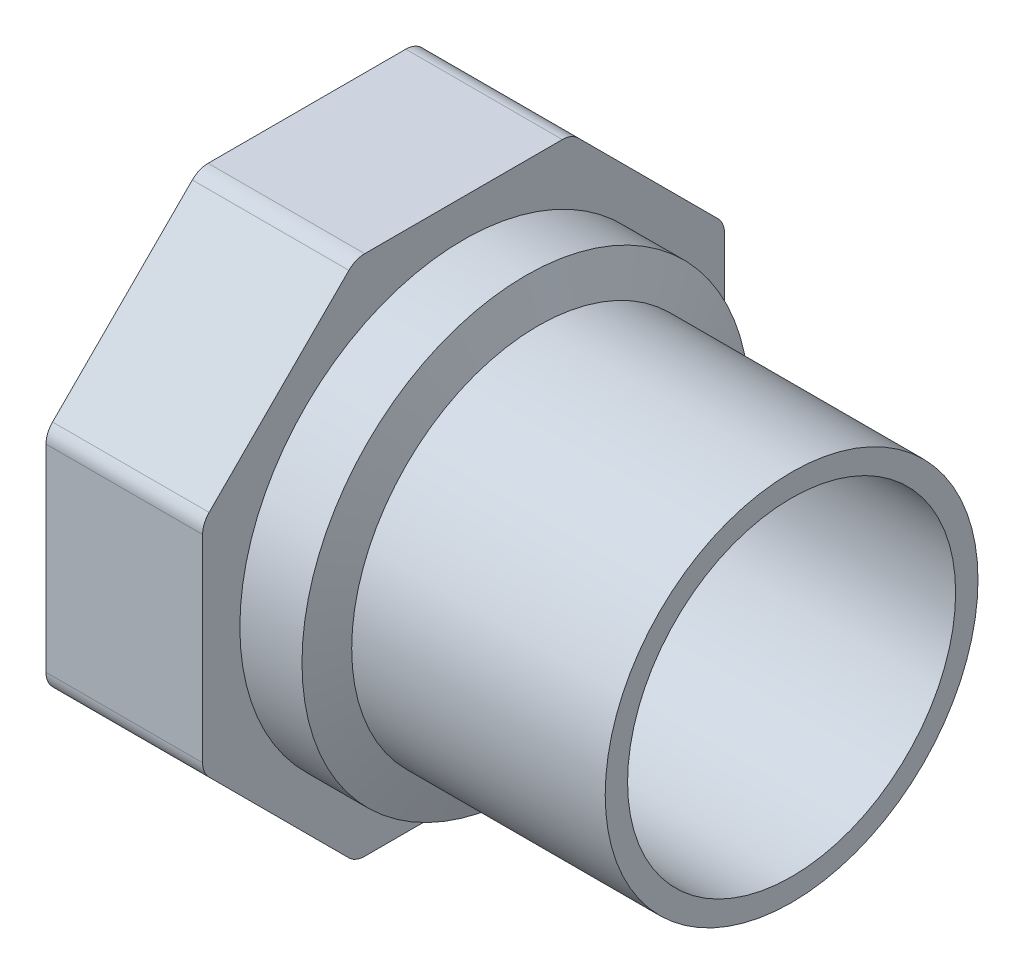
ISO-10303-21;
HEADER;
FILE_DESCRIPTION(('STEP AP214'),'2;1');
FILE_NAME('part.step','',(''),(''),'','','');
FILE_SCHEMA(('AUTOMOTIVE_DESIGN { 1 0 10303 214 1 1 1 1 }'));
ENDSEC;
DATA;
#1=APPLICATION_CONTEXT('core data for automotive mechanical design processes');
#2=APPLICATION_PROTOCOL_DEFINITION('international standard','automotive_design',2000,#1);
#3=PRODUCT_CONTEXT('',#1,'mechanical');
#4=PRODUCT('Part','Part','',(#3));
#5=PRODUCT_RELATED_PRODUCT_CATEGORY('part','',(#4));
#6=PRODUCT_DEFINITION_FORMATION('','',#4);
#7=PRODUCT_DEFINITION_CONTEXT('part definition',#1,'design');
#8=PRODUCT_DEFINITION('design','',#6,#7);
#9=PRODUCT_DEFINITION_SHAPE('','',#8);
#10=(LENGTH_UNIT() NAMED_UNIT(*) SI_UNIT(.MILLI.,.METRE.));
#11=(NAMED_UNIT(*) PLANE_ANGLE_UNIT() SI_UNIT($,.RADIAN.));
#12=(NAMED_UNIT(*) SI_UNIT($,.STERADIAN.) SOLID_ANGLE_UNIT());
#13=UNCERTAINTY_MEASURE_WITH_UNIT(LENGTH_MEASURE(1.E-05),#10,'distance_accuracy_value','');
#14=(GEOMETRIC_REPRESENTATION_CONTEXT(3) GLOBAL_UNCERTAINTY_ASSIGNED_CONTEXT((#13)) GLOBAL_UNIT_ASSIGNED_CONTEXT((#10,
#11,#12)) REPRESENTATION_CONTEXT('',''));
#15=CARTESIAN_POINT('',(0.,0.,0.));
#16=DIRECTION('',(0.,0.,1.));
#17=DIRECTION('',(1.,0.,0.));
#18=AXIS2_PLACEMENT_3D('',#15,#16,#17);
#19=CARTESIAN_POINT('',(-34.,0.,0.));
#20=DIRECTION('',(-1.,0.,0.));
#21=DIRECTION('',(0.,0.,1.));
#22=AXIS2_PLACEMENT_3D('',#19,#20,#21);
#23=CYLINDRICAL_SURFACE('',#22,25.);
#24=CARTESIAN_POINT('',(-34.,0.,0.));
#25=DIRECTION('',(1.,0.,0.));
#26=DIRECTION('',(0.,1.,0.));
#27=AXIS2_PLACEMENT_3D('',#24,#25,#26);
#28=CIRCLE('',#27,25.);
#29=CARTESIAN_POINT('',(-34.,25.,0.));
#30=VERTEX_POINT('',#29);
#31=EDGE_CURVE('E193',#30,#30,#28,.F.);
#32=ORIENTED_EDGE('',*,*,#31,.F.);
#33=EDGE_LOOP('',(#32));
#34=FACE_BOUND('',#33,.T.);
#35=CARTESIAN_POINT('',(0.,0.,0.));
#36=DIRECTION('',(-1.,0.,0.));
#37=DIRECTION('',(0.,0.,1.));
#38=AXIS2_PLACEMENT_3D('',#35,#36,#37);
#39=CIRCLE('',#38,25.);
#40=CARTESIAN_POINT('',(0.,0.,25.));
#41=VERTEX_POINT('',#40);
#42=EDGE_CURVE('E18',#41,#41,#39,.F.);
#43=ORIENTED_EDGE('',*,*,#42,.F.);
#44=EDGE_LOOP('',(#43));
#45=FACE_BOUND('',#44,.T.);
#46=ADVANCED_FACE('F15',(#34,#45),#23,.T.);
#47=CARTESIAN_POINT('',(-34.,0.,0.));
#48=DIRECTION('',(-1.,0.,0.));
#49=DIRECTION('',(0.,0.,1.));
#50=AXIS2_PLACEMENT_3D('',#47,#48,#49);
#51=CONICAL_SURFACE('',#50,25.,1.24904577239826);
#52=CARTESIAN_POINT('',(-35.6666666666666,0.,0.));
#53=DIRECTION('',(-1.,0.,0.));
#54=DIRECTION('',(0.,1.,0.));
#55=AXIS2_PLACEMENT_3D('',#52,#53,#54);
#56=CIRCLE('',#55,30.);
#57=CARTESIAN_POINT('',(-35.6666666666666,30.,0.));
#58=VERTEX_POINT('',#57);
#59=EDGE_CURVE('E189',#58,#58,#56,.T.);
#60=ORIENTED_EDGE('',*,*,#59,.F.);
#61=EDGE_LOOP('',(#60));
#62=FACE_BOUND('',#61,.T.);
#63=ORIENTED_EDGE('',*,*,#31,.T.);
#64=EDGE_LOOP('',(#63));
#65=FACE_BOUND('',#64,.T.);
#66=ADVANCED_FACE('F268',(#62,#65),#51,.T.);
#67=CARTESIAN_POINT('',(0.,25.,25.3000021083545));
#68=DIRECTION('',(1.,0.,0.));
#69=DIRECTION('',(0.,-1.,0.));
#70=AXIS2_PLACEMENT_3D('',#67,#68,#69);
#71=PLANE('',#70);
#72=CARTESIAN_POINT('',(0.,0.,0.));
#73=DIRECTION('',(-1.,0.,0.));
#74=DIRECTION('',(0.,0.,1.));
#75=AXIS2_PLACEMENT_3D('',#72,#73,#74);
#76=CIRCLE('',#75,22.);
#77=CARTESIAN_POINT('',(0.,0.,22.));
#78=VERTEX_POINT('',#77);
#79=EDGE_CURVE('E192',#78,#78,#76,.F.);
#80=ORIENTED_EDGE('',*,*,#79,.F.);
#81=EDGE_LOOP('',(#80));
#82=FACE_BOUND('',#81,.T.);
#83=ORIENTED_EDGE('',*,*,#42,.T.);
#84=EDGE_LOOP('',(#83));
#85=FACE_BOUND('',#84,.T.);
#86=ADVANCED_FACE('F264',(#82,#85),#71,.T.);
#87=CARTESIAN_POINT('',(-44.,0.,0.));
#88=DIRECTION('',(-1.,0.,0.));
#89=DIRECTION('',(0.,0.,1.));
#90=AXIS2_PLACEMENT_3D('',#87,#88,#89);
#91=CYLINDRICAL_SURFACE('',#90,30.);
#92=CARTESIAN_POINT('',(-44.,0.,0.));
#93=DIRECTION('',(-1.,0.,0.));
#94=DIRECTION('',(0.,0.,1.));
#95=AXIS2_PLACEMENT_3D('',#92,#93,#94);
#96=CIRCLE('',#95,30.);
#97=CARTESIAN_POINT('',(-44.,0.,30.));
#98=VERTEX_POINT('',#97);
#99=EDGE_CURVE('E188',#98,#98,#96,.T.);
#100=ORIENTED_EDGE('',*,*,#99,.F.);
#101=EDGE_LOOP('',(#100));
#102=FACE_BOUND('',#101,.T.);
#103=ORIENTED_EDGE('',*,*,#59,.T.);
#104=EDGE_LOOP('',(#103));
#105=FACE_BOUND('',#104,.T.);
#106=ADVANCED_FACE('F267',(#102,#105),#91,.T.);
#107=CARTESIAN_POINT('',(0.,0.,0.));
#108=DIRECTION('',(-1.,0.,0.));
#109=DIRECTION('',(0.,0.,1.));
#110=AXIS2_PLACEMENT_3D('',#107,#108,#109);
#111=CYLINDRICAL_SURFACE('',#110,22.);
#112=ORIENTED_EDGE('',*,*,#79,.T.);
#113=EDGE_LOOP('',(#112));
#114=FACE_BOUND('',#113,.T.);
#115=CARTESIAN_POINT('',(-44.4207236084772,0.,0.));
#116=DIRECTION('',(1.,0.,0.));
#117=DIRECTION('',(0.,1.,0.));
#118=AXIS2_PLACEMENT_3D('',#115,#116,#117);
#119=CIRCLE('',#118,22.);
#120=CARTESIAN_POINT('',(-44.4207236084772,22.,0.));
#121=VERTEX_POINT('',#120);
#122=EDGE_CURVE('E135',#121,#121,#119,.T.);
#123=ORIENTED_EDGE('',*,*,#122,.F.);
#124=EDGE_LOOP('',(#123));
#125=FACE_BOUND('',#124,.T.);
#126=ADVANCED_FACE('F261',(#114,#125),#111,.F.);
#127=CARTESIAN_POINT('',(-44.,35.,35.));
#128=DIRECTION('',(1.,0.,0.));
#129=DIRECTION('',(0.,-1.,0.));
#130=AXIS2_PLACEMENT_3D('',#127,#128,#129);
#131=PLANE('',#130);
#132=ORIENTED_EDGE('',*,*,#99,.T.);
#133=EDGE_LOOP('',(#132));
#134=FACE_BOUND('',#133,.T.);
#135=CARTESIAN_POINT('',(-44.,13.254833995939,32.));
#136=DIRECTION('',(1.,0.,0.));
#137=DIRECTION('',(0.,0.,-1.));
#138=AXIS2_PLACEMENT_3D('',#135,#136,#137);
#139=CIRCLE('',#138,3.00000000000005);
#140=CARTESIAN_POINT('',(-44.,13.254833995939,35.));
#141=VERTEX_POINT('',#140);
#142=CARTESIAN_POINT('',(-44.,15.3761543394987,34.1213203435597));
#143=VERTEX_POINT('',#142);
#144=EDGE_CURVE('E254',#141,#143,#139,.F.);
#145=ORIENTED_EDGE('',*,*,#144,.F.);
#146=DIRECTION('',(0.,1.,0.));
#147=VECTOR('',#146,1.);
#148=CARTESIAN_POINT('',(-44.,0.,35.));
#149=LINE('',#148,#147);
#150=CARTESIAN_POINT('',(-44.,-13.254833995939,35.));
#151=VERTEX_POINT('',#150);
#152=EDGE_CURVE('E132',#151,#141,#149,.T.);
#153=ORIENTED_EDGE('',*,*,#152,.F.);
#154=CARTESIAN_POINT('',(-44.,-13.254833995939,31.9999999999999));
#155=DIRECTION('',(1.,0.,0.));
#156=DIRECTION('',(0.,0.,-1.));
#157=AXIS2_PLACEMENT_3D('',#154,#155,#156);
#158=CIRCLE('',#157,3.00000000000011);
#159=CARTESIAN_POINT('',(-44.,-15.3761543394987,34.1213203435596));
#160=VERTEX_POINT('',#159);
#161=EDGE_CURVE('E126',#160,#151,#158,.F.);
#162=ORIENTED_EDGE('',*,*,#161,.F.);
#163=DIRECTION('',(0.,0.707106781186547,0.707106781186548));
#164=VECTOR('',#163,1.);
#165=CARTESIAN_POINT('',(-44.,-24.7487373415292,24.7487373415292));
#166=LINE('',#165,#164);
#167=CARTESIAN_POINT('',(-44.,-34.1213203435597,15.3761543394987));
#168=VERTEX_POINT('',#167);
#169=EDGE_CURVE('E130',#168,#160,#166,.T.);
#170=ORIENTED_EDGE('',*,*,#169,.F.);
#171=CARTESIAN_POINT('',(-44.,-31.9999999999999,13.254833995939));
#172=DIRECTION('',(1.,0.,0.));
#173=DIRECTION('',(0.,0.,-1.));
#174=AXIS2_PLACEMENT_3D('',#171,#172,#173);
#175=CIRCLE('',#174,3.00000000000007);
#176=CARTESIAN_POINT('',(-44.,-35.,13.254833995939));
#177=VERTEX_POINT('',#176);
#178=EDGE_CURVE('E149',#177,#168,#175,.F.);
#179=ORIENTED_EDGE('',*,*,#178,.F.);
#180=DIRECTION('',(0.,0.,1.));
#181=VECTOR('',#180,1.);
#182=CARTESIAN_POINT('',(-44.,-35.,0.));
#183=LINE('',#182,#181);
#184=CARTESIAN_POINT('',(-44.,-35.,-13.2548339959391));
#185=VERTEX_POINT('',#184);
#186=EDGE_CURVE('E154',#185,#177,#183,.T.);
#187=ORIENTED_EDGE('',*,*,#186,.F.);
#188=CARTESIAN_POINT('',(-44.,-32.,-13.2548339959391));
#189=DIRECTION('',(1.,0.,0.));
#190=DIRECTION('',(0.,0.,-1.));
#191=AXIS2_PLACEMENT_3D('',#188,#189,#190);
#192=CIRCLE('',#191,2.99999999999996);
#193=CARTESIAN_POINT('',(-44.,-34.1213203435597,-15.3761543394987));
#194=VERTEX_POINT('',#193);
#195=EDGE_CURVE('E239',#194,#185,#192,.F.);
#196=ORIENTED_EDGE('',*,*,#195,.F.);
#197=DIRECTION('',(0.,-0.707106781186548,0.707106781186547));
#198=VECTOR('',#197,1.);
#199=CARTESIAN_POINT('',(-44.,-24.7487373415292,-24.7487373415292));
#200=LINE('',#199,#198);
#201=CARTESIAN_POINT('',(-44.,-15.3761543394987,-34.1213203435597));
#202=VERTEX_POINT('',#201);
#203=EDGE_CURVE('E159',#202,#194,#200,.T.);
#204=ORIENTED_EDGE('',*,*,#203,.F.);
#205=CARTESIAN_POINT('',(-44.,-13.254833995939,-32.));
#206=DIRECTION('',(1.,0.,0.));
#207=DIRECTION('',(0.,0.,-1.));
#208=AXIS2_PLACEMENT_3D('',#205,#206,#207);
#209=CIRCLE('',#208,2.99999999999998);
#210=CARTESIAN_POINT('',(-44.,-13.254833995939,-35.));
#211=VERTEX_POINT('',#210);
#212=EDGE_CURVE('E242',#211,#202,#209,.F.);
#213=ORIENTED_EDGE('',*,*,#212,.F.);
#214=DIRECTION('',(0.,-1.,0.));
#215=VECTOR('',#214,1.);
#216=CARTESIAN_POINT('',(-44.,0.,-35.));
#217=LINE('',#216,#215);
#218=CARTESIAN_POINT('',(-44.,13.254833995939,-35.));
#219=VERTEX_POINT('',#218);
#220=EDGE_CURVE('E164',#219,#211,#217,.T.);
#221=ORIENTED_EDGE('',*,*,#220,.F.);
#222=CARTESIAN_POINT('',(-44.,13.254833995939,-31.9999999999999));
#223=DIRECTION('',(1.,0.,0.));
#224=DIRECTION('',(0.,0.,-1.));
#225=AXIS2_PLACEMENT_3D('',#222,#223,#224);
#226=CIRCLE('',#225,3.00000000000007);
#227=CARTESIAN_POINT('',(-44.,15.3761543394987,-34.1213203435596));
#228=VERTEX_POINT('',#227);
#229=EDGE_CURVE('E245',#228,#219,#226,.F.);
#230=ORIENTED_EDGE('',*,*,#229,.F.);
#231=DIRECTION('',(0.,-0.707106781186547,-0.707106781186547));
#232=VECTOR('',#231,1.);
#233=CARTESIAN_POINT('',(-44.,24.7487373415292,-24.7487373415292));
#234=LINE('',#233,#232);
#235=CARTESIAN_POINT('',(-44.,34.1213203435597,-15.3761543394987));
#236=VERTEX_POINT('',#235);
#237=EDGE_CURVE('E169',#236,#228,#234,.T.);
#238=ORIENTED_EDGE('',*,*,#237,.F.);
#239=CARTESIAN_POINT('',(-44.,32.,-13.254833995939));
#240=DIRECTION('',(1.,0.,0.));
#241=DIRECTION('',(0.,0.,-1.));
#242=AXIS2_PLACEMENT_3D('',#239,#240,#241);
#243=CIRCLE('',#242,3.00000000000005);
#244=CARTESIAN_POINT('',(-44.,35.,-13.254833995939));
#245=VERTEX_POINT('',#244);
#246=EDGE_CURVE('E248',#245,#236,#243,.F.);
#247=ORIENTED_EDGE('',*,*,#246,.F.);
#248=DIRECTION('',(0.,0.,-1.));
#249=VECTOR('',#248,1.);
#250=CARTESIAN_POINT('',(-44.,35.,0.));
#251=LINE('',#250,#249);
#252=CARTESIAN_POINT('',(-44.,35.,13.254833995939));
#253=VERTEX_POINT('',#252);
#254=EDGE_CURVE('E174',#253,#245,#251,.T.);
#255=ORIENTED_EDGE('',*,*,#254,.F.);
#256=CARTESIAN_POINT('',(-44.,31.9999999999999,13.254833995939));
#257=DIRECTION('',(1.,0.,0.));
#258=DIRECTION('',(0.,0.,-1.));
#259=AXIS2_PLACEMENT_3D('',#256,#257,#258);
#260=CIRCLE('',#259,3.00000000000006);
#261=CARTESIAN_POINT('',(-44.,34.1213203435597,15.3761543394987));
#262=VERTEX_POINT('',#261);
#263=EDGE_CURVE('E251',#262,#253,#260,.F.);
#264=ORIENTED_EDGE('',*,*,#263,.F.);
#265=DIRECTION('',(0.,0.707106781186548,-0.707106781186547));
#266=VECTOR('',#265,1.);
#267=CARTESIAN_POINT('',(-44.,24.7487373415292,24.7487373415292));
#268=LINE('',#267,#266);
#269=EDGE_CURVE('E179',#143,#262,#268,.T.);
#270=ORIENTED_EDGE('',*,*,#269,.F.);
#271=EDGE_LOOP('',(#145,#153,#162,#170,#179,#187,#196,#204,#213,#221,#230,#238,#247,#255,#264,#270));
#272=FACE_BOUND('',#271,.T.);
#273=ADVANCED_FACE('F128',(#134,#272),#131,.T.);
#274=CARTESIAN_POINT('',(-44.,0.,0.));
#275=DIRECTION('',(-1.,0.,0.));
#276=DIRECTION('',(0.,0.,1.));
#277=AXIS2_PLACEMENT_3D('',#274,#275,#276);
#278=CONICAL_SURFACE('',#277,21.2712853341737,1.04719755119659);
#279=ORIENTED_EDGE('',*,*,#122,.T.);
#280=EDGE_LOOP('',(#279));
#281=FACE_BOUND('',#280,.T.);
#282=CARTESIAN_POINT('',(-44.,0.,0.));
#283=DIRECTION('',(1.,0.,0.));
#284=DIRECTION('',(0.,1.,0.));
#285=AXIS2_PLACEMENT_3D('',#282,#283,#284);
#286=CIRCLE('',#285,21.2712853341737);
#287=CARTESIAN_POINT('',(-44.,21.2712853341737,0.));
#288=VERTEX_POINT('',#287);
#289=EDGE_CURVE('E153',#288,#288,#286,.T.);
#290=ORIENTED_EDGE('',*,*,#289,.F.);
#291=EDGE_LOOP('',(#290));
#292=FACE_BOUND('',#291,.T.);
#293=ADVANCED_FACE('F438',(#281,#292),#278,.T.);
#294=CARTESIAN_POINT('',(-44.,-13.254833995939,31.9999999999999));
#295=DIRECTION('',(1.,0.,0.));
#296=DIRECTION('',(0.,0.,-1.));
#297=AXIS2_PLACEMENT_3D('',#294,#295,#296);
#298=CYLINDRICAL_SURFACE('',#297,3.00000000000011);
#299=CARTESIAN_POINT('',(-65.,-13.254833995939,31.9999999999999));
#300=DIRECTION('',(1.,0.,0.));
#301=DIRECTION('',(0.,0.,-1.));
#302=AXIS2_PLACEMENT_3D('',#299,#300,#301);
#303=CIRCLE('',#302,3.00000000000011);
#304=CARTESIAN_POINT('',(-65.,-15.3761543394987,34.1213203435597));
#305=VERTEX_POINT('',#304);
#306=CARTESIAN_POINT('',(-65.,-13.254833995939,35.));
#307=VERTEX_POINT('',#306);
#308=EDGE_CURVE('E141',#305,#307,#303,.F.);
#309=ORIENTED_EDGE('',*,*,#308,.F.);
#310=DIRECTION('',(1.,0.,0.));
#311=VECTOR('',#310,1.);
#312=CARTESIAN_POINT('',(-65.,-15.3761543394987,34.1213203435597));
#313=LINE('',#312,#311);
#314=EDGE_CURVE('E138',#160,#305,#313,.F.);
#315=ORIENTED_EDGE('',*,*,#314,.F.);
#316=ORIENTED_EDGE('',*,*,#161,.T.);
#317=DIRECTION('',(1.,0.,0.));
#318=VECTOR('',#317,1.);
#319=CARTESIAN_POINT('',(-65.,-13.254833995939,35.));
#320=LINE('',#319,#318);
#321=EDGE_CURVE('E185',#307,#151,#320,.T.);
#322=ORIENTED_EDGE('',*,*,#321,.F.);
#323=EDGE_LOOP('',(#309,#315,#316,#322));
#324=FACE_BOUND('',#323,.T.);
#325=ADVANCED_FACE('F139',(#324),#298,.T.);
#326=CARTESIAN_POINT('',(-65.,13.254833995939,35.));
#327=DIRECTION('',(0.,0.,1.));
#328=DIRECTION('',(0.,-1.,0.));
#329=AXIS2_PLACEMENT_3D('',#326,#327,#328);
#330=PLANE('',#329);
#331=DIRECTION('',(0.,1.,0.));
#332=VECTOR('',#331,1.);
#333=CARTESIAN_POINT('',(-65.,0.,35.));
#334=LINE('',#333,#332);
#335=CARTESIAN_POINT('',(-65.,13.254833995939,35.));
#336=VERTEX_POINT('',#335);
#337=EDGE_CURVE('E236',#307,#336,#334,.T.);
#338=ORIENTED_EDGE('',*,*,#337,.F.);
#339=ORIENTED_EDGE('',*,*,#321,.T.);
#340=ORIENTED_EDGE('',*,*,#152,.T.);
#341=DIRECTION('',(1.,0.,0.));
#342=VECTOR('',#341,1.);
#343=CARTESIAN_POINT('',(-54.5,13.254833995939,35.));
#344=LINE('',#343,#342);
#345=EDGE_CURVE('E183',#336,#141,#344,.T.);
#346=ORIENTED_EDGE('',*,*,#345,.F.);
#347=EDGE_LOOP('',(#338,#339,#340,#346));
#348=FACE_BOUND('',#347,.T.);
#349=ADVANCED_FACE('F387',(#348),#330,.T.);
#350=CARTESIAN_POINT('',(-44.,13.254833995939,32.));
#351=DIRECTION('',(1.,0.,0.));
#352=DIRECTION('',(0.,0.,-1.));
#353=AXIS2_PLACEMENT_3D('',#350,#351,#352);
#354=CYLINDRICAL_SURFACE('',#353,3.00000000000005);
#355=CARTESIAN_POINT('',(-65.,13.254833995939,32.));
#356=DIRECTION('',(1.,0.,0.));
#357=DIRECTION('',(0.,0.,-1.));
#358=AXIS2_PLACEMENT_3D('',#355,#356,#357);
#359=CIRCLE('',#358,3.00000000000005);
#360=CARTESIAN_POINT('',(-65.,15.3761543394987,34.1213203435597));
#361=VERTEX_POINT('',#360);
#362=EDGE_CURVE('E233',#336,#361,#359,.F.);
#363=ORIENTED_EDGE('',*,*,#362,.F.);
#364=ORIENTED_EDGE('',*,*,#345,.T.);
#365=ORIENTED_EDGE('',*,*,#144,.T.);
#366=DIRECTION('',(1.,0.,0.));
#367=VECTOR('',#366,1.);
#368=CARTESIAN_POINT('',(-65.,15.3761543394987,34.1213203435597));
#369=LINE('',#368,#367);
#370=EDGE_CURVE('E182',#361,#143,#369,.T.);
#371=ORIENTED_EDGE('',*,*,#370,.F.);
#372=EDGE_LOOP('',(#363,#364,#365,#371));
#373=FACE_BOUND('',#372,.T.);
#374=ADVANCED_FACE('F425',(#373),#354,.T.);
#375=CARTESIAN_POINT('',(-65.,34.1213203435597,15.3761543394987));
#376=DIRECTION('',(0.,0.707106781186547,0.707106781186548));
#377=DIRECTION('',(0.,-0.707106781186548,0.707106781186547));
#378=AXIS2_PLACEMENT_3D('',#375,#376,#377);
#379=PLANE('',#378);
#380=CARTESIAN_POINT('',(-65.,15.3761543394987,34.1213203435597));
#381=CARTESIAN_POINT('',(-65.,16.1572029230012,33.3402717600571));
#382=CARTESIAN_POINT('',(-65.,16.9382515065038,32.5592231765546));
#383=CARTESIAN_POINT('',(-65.,18.5003486735088,30.9971260095495));
#384=CARTESIAN_POINT('',(-65.,19.2813972570114,30.216077426047));
#385=CARTESIAN_POINT('',(-65.,20.8434944240165,28.6539802590419));
#386=CARTESIAN_POINT('',(-65.,21.624543007519,27.8729316755393));
#387=CARTESIAN_POINT('',(-65.,23.1866401745241,26.3108345085343));
#388=CARTESIAN_POINT('',(-65.,23.9676887580266,25.5297859250317));
#389=CARTESIAN_POINT('',(-65.,25.5297859250317,23.9676887580266));
#390=CARTESIAN_POINT('',(-65.,26.3108345085343,23.1866401745241));
#391=CARTESIAN_POINT('',(-65.,27.8729316755393,21.624543007519));
#392=CARTESIAN_POINT('',(-65.,28.6539802590419,20.8434944240165));
#393=CARTESIAN_POINT('',(-65.,30.216077426047,19.2813972570114));
#394=CARTESIAN_POINT('',(-65.,30.9971260095495,18.5003486735089));
#395=CARTESIAN_POINT('',(-65.,32.5592231765546,16.9382515065038));
#396=CARTESIAN_POINT('',(-65.,33.3402717600571,16.1572029230012));
#397=CARTESIAN_POINT('',(-65.,34.1213203435597,15.3761543394987));
#398=B_SPLINE_CURVE_WITH_KNOTS('',3,(#380,#381,#382,#383,#384,#385,#386,#387,#388,#389,#390,
#391,#392,#393,#394,#395,#396,#397),.UNSPECIFIED.,.F.,.F.,(4,2,2,2,2,2,2,2,4),(0.,
3.31370849898476,6.62741699796953,9.94112549695429,13.2548339959391,16.5685424949238,
19.8822509939086,23.1959594928934,26.5096679918781),.UNSPECIFIED.);
#399=CARTESIAN_POINT('',(-65.,34.1213203435597,15.3761543394987));
#400=VERTEX_POINT('',#399);
#401=EDGE_CURVE('E232',#361,#400,#398,.T.);
#402=ORIENTED_EDGE('',*,*,#401,.F.);
#403=ORIENTED_EDGE('',*,*,#370,.T.);
#404=ORIENTED_EDGE('',*,*,#269,.T.);
#405=DIRECTION('',(1.,0.,0.));
#406=VECTOR('',#405,1.);
#407=CARTESIAN_POINT('',(-54.5,34.1213203435597,15.3761543394987));
#408=LINE('',#407,#406);
#409=EDGE_CURVE('E178',#400,#262,#408,.T.);
#410=ORIENTED_EDGE('',*,*,#409,.F.);
#411=EDGE_LOOP('',(#402,#403,#404,#410));
#412=FACE_BOUND('',#411,.T.);
#413=ADVANCED_FACE('F423',(#412),#379,.T.);
#414=CARTESIAN_POINT('',(-44.,31.9999999999999,13.254833995939));
#415=DIRECTION('',(1.,0.,0.));
#416=DIRECTION('',(0.,0.,-1.));
#417=AXIS2_PLACEMENT_3D('',#414,#415,#416);
#418=CYLINDRICAL_SURFACE('',#417,3.00000000000006);
#419=CARTESIAN_POINT('',(-65.,31.9999999999999,13.254833995939));
#420=DIRECTION('',(1.,0.,0.));
#421=DIRECTION('',(0.,0.,-1.));
#422=AXIS2_PLACEMENT_3D('',#419,#420,#421);
#423=CIRCLE('',#422,3.00000000000006);
#424=CARTESIAN_POINT('',(-65.,35.,13.254833995939));
#425=VERTEX_POINT('',#424);
#426=EDGE_CURVE('E229',#400,#425,#423,.F.);
#427=ORIENTED_EDGE('',*,*,#426,.F.);
#428=ORIENTED_EDGE('',*,*,#409,.T.);
#429=ORIENTED_EDGE('',*,*,#263,.T.);
#430=DIRECTION('',(1.,0.,0.));
#431=VECTOR('',#430,1.);
#432=CARTESIAN_POINT('',(-65.,35.,13.254833995939));
#433=LINE('',#432,#431);
#434=EDGE_CURVE('E177',#425,#253,#433,.T.);
#435=ORIENTED_EDGE('',*,*,#434,.F.);
#436=EDGE_LOOP('',(#427,#428,#429,#435));
#437=FACE_BOUND('',#436,.T.);
#438=ADVANCED_FACE('F420',(#437),#418,.T.);
#439=CARTESIAN_POINT('',(-65.,35.,-13.254833995939));
#440=DIRECTION('',(0.,1.,0.));
#441=DIRECTION('',(0.,0.,1.));
#442=AXIS2_PLACEMENT_3D('',#439,#440,#441);
#443=PLANE('',#442);
#444=DIRECTION('',(0.,0.,-1.));
#445=VECTOR('',#444,1.);
#446=CARTESIAN_POINT('',(-65.,35.,35.));
#447=LINE('',#446,#445);
#448=CARTESIAN_POINT('',(-65.,35.,-13.254833995939));
#449=VERTEX_POINT('',#448);
#450=EDGE_CURVE('E228',#425,#449,#447,.T.);
#451=ORIENTED_EDGE('',*,*,#450,.F.);
#452=ORIENTED_EDGE('',*,*,#434,.T.);
#453=ORIENTED_EDGE('',*,*,#254,.T.);
#454=DIRECTION('',(1.,0.,0.));
#455=VECTOR('',#454,1.);
#456=CARTESIAN_POINT('',(-54.5,35.,-13.254833995939));
#457=LINE('',#456,#455);
#458=EDGE_CURVE('E173',#449,#245,#457,.T.);
#459=ORIENTED_EDGE('',*,*,#458,.F.);
#460=EDGE_LOOP('',(#451,#452,#453,#459));
#461=FACE_BOUND('',#460,.T.);
#462=ADVANCED_FACE('F417',(#461),#443,.T.);
#463=CARTESIAN_POINT('',(-44.,32.,-13.254833995939));
#464=DIRECTION('',(1.,0.,0.));
#465=DIRECTION('',(0.,0.,-1.));
#466=AXIS2_PLACEMENT_3D('',#463,#464,#465);
#467=CYLINDRICAL_SURFACE('',#466,3.00000000000005);
#468=CARTESIAN_POINT('',(-65.,32.,-13.254833995939));
#469=DIRECTION('',(1.,0.,0.));
#470=DIRECTION('',(0.,0.,-1.));
#471=AXIS2_PLACEMENT_3D('',#468,#469,#470);
#472=CIRCLE('',#471,3.00000000000005);
#473=CARTESIAN_POINT('',(-65.,34.1213203435597,-15.3761543394987));
#474=VERTEX_POINT('',#473);
#475=EDGE_CURVE('E225',#449,#474,#472,.F.);
#476=ORIENTED_EDGE('',*,*,#475,.F.);
#477=ORIENTED_EDGE('',*,*,#458,.T.);
#478=ORIENTED_EDGE('',*,*,#246,.T.);
#479=DIRECTION('',(1.,0.,0.));
#480=VECTOR('',#479,1.);
#481=CARTESIAN_POINT('',(-65.,34.1213203435597,-15.3761543394987));
#482=LINE('',#481,#480);
#483=EDGE_CURVE('E172',#474,#236,#482,.T.);
#484=ORIENTED_EDGE('',*,*,#483,.F.);
#485=EDGE_LOOP('',(#476,#477,#478,#484));
#486=FACE_BOUND('',#485,.T.);
#487=ADVANCED_FACE('F414',(#486),#467,.T.);
#488=CARTESIAN_POINT('',(-65.,15.3761543394987,-34.1213203435596));
#489=DIRECTION('',(0.,0.707106781186547,-0.707106781186547));
#490=DIRECTION('',(0.,0.707106781186547,0.707106781186547));
#491=AXIS2_PLACEMENT_3D('',#488,#489,#490);
#492=PLANE('',#491);
#493=CARTESIAN_POINT('',(-65.,34.1213203435597,-15.3761543394987));
#494=CARTESIAN_POINT('',(-65.,33.3402717600571,-16.1572029230012));
#495=CARTESIAN_POINT('',(-65.,32.5592231765546,-16.9382515065038));
#496=CARTESIAN_POINT('',(-65.,30.9971260095495,-18.5003486735088));
#497=CARTESIAN_POINT('',(-65.,30.216077426047,-19.2813972570114));
#498=CARTESIAN_POINT('',(-65.,28.6539802590419,-20.8434944240165));
#499=CARTESIAN_POINT('',(-65.,27.8729316755393,-21.624543007519));
#500=CARTESIAN_POINT('',(-65.,26.3108345085343,-23.1866401745241));
#501=CARTESIAN_POINT('',(-65.,25.5297859250317,-23.9676887580266));
#502=CARTESIAN_POINT('',(-65.,23.9676887580266,-25.5297859250317));
#503=CARTESIAN_POINT('',(-65.,23.1866401745241,-26.3108345085342));
#504=CARTESIAN_POINT('',(-65.,21.624543007519,-27.8729316755393));
#505=CARTESIAN_POINT('',(-65.,20.8434944240165,-28.6539802590419));
#506=CARTESIAN_POINT('',(-65.,19.2813972570114,-30.2160774260469));
#507=CARTESIAN_POINT('',(-65.,18.5003486735089,-30.9971260095495));
#508=CARTESIAN_POINT('',(-65.,16.9382515065038,-32.5592231765546));
#509=CARTESIAN_POINT('',(-65.,16.1572029230012,-33.3402717600571));
#510=CARTESIAN_POINT('',(-65.,15.3761543394987,-34.1213203435596));
#511=B_SPLINE_CURVE_WITH_KNOTS('',3,(#493,#494,#495,#496,#497,#498,#499,#500,#501,#502,#503,
#504,#505,#506,#507,#508,#509,#510),.UNSPECIFIED.,.F.,.F.,(4,2,2,2,2,2,2,2,4),(0.,
3.31370849898477,6.62741699796952,9.94112549695429,13.254833995939,16.5685424949238,
19.8822509939086,23.1959594928933,26.5096679918781),.UNSPECIFIED.);
#512=CARTESIAN_POINT('',(-65.,15.3761543394987,-34.1213203435596));
#513=VERTEX_POINT('',#512);
#514=EDGE_CURVE('E224',#474,#513,#511,.T.);
#515=ORIENTED_EDGE('',*,*,#514,.F.);
#516=ORIENTED_EDGE('',*,*,#483,.T.);
#517=ORIENTED_EDGE('',*,*,#237,.T.);
#518=DIRECTION('',(1.,0.,0.));
#519=VECTOR('',#518,1.);
#520=CARTESIAN_POINT('',(-54.5,15.3761543394987,-34.1213203435596));
#521=LINE('',#520,#519);
#522=EDGE_CURVE('E168',#513,#228,#521,.T.);
#523=ORIENTED_EDGE('',*,*,#522,.F.);
#524=EDGE_LOOP('',(#515,#516,#517,#523));
#525=FACE_BOUND('',#524,.T.);
#526=ADVANCED_FACE('F411',(#525),#492,.T.);
#527=CARTESIAN_POINT('',(-44.,13.254833995939,-31.9999999999999));
#528=DIRECTION('',(1.,0.,0.));
#529=DIRECTION('',(0.,0.,-1.));
#530=AXIS2_PLACEMENT_3D('',#527,#528,#529);
#531=CYLINDRICAL_SURFACE('',#530,3.00000000000007);
#532=CARTESIAN_POINT('',(-65.,13.254833995939,-31.9999999999999));
#533=DIRECTION('',(1.,0.,0.));
#534=DIRECTION('',(0.,0.,-1.));
#535=AXIS2_PLACEMENT_3D('',#532,#533,#534);
#536=CIRCLE('',#535,3.00000000000007);
#537=CARTESIAN_POINT('',(-65.,13.254833995939,-35.));
#538=VERTEX_POINT('',#537);
#539=EDGE_CURVE('E221',#513,#538,#536,.F.);
#540=ORIENTED_EDGE('',*,*,#539,.F.);
#541=ORIENTED_EDGE('',*,*,#522,.T.);
#542=ORIENTED_EDGE('',*,*,#229,.T.);
#543=DIRECTION('',(1.,0.,0.));
#544=VECTOR('',#543,1.);
#545=CARTESIAN_POINT('',(-65.,13.254833995939,-35.));
#546=LINE('',#545,#544);
#547=EDGE_CURVE('E167',#538,#219,#546,.T.);
#548=ORIENTED_EDGE('',*,*,#547,.F.);
#549=EDGE_LOOP('',(#540,#541,#542,#548));
#550=FACE_BOUND('',#549,.T.);
#551=ADVANCED_FACE('F408',(#550),#531,.T.);
#552=CARTESIAN_POINT('',(-65.,-13.254833995939,-35.));
#553=DIRECTION('',(0.,0.,-1.));
#554=DIRECTION('',(0.,1.,0.));
#555=AXIS2_PLACEMENT_3D('',#552,#553,#554);
#556=PLANE('',#555);
#557=DIRECTION('',(0.,-1.,0.));
#558=VECTOR('',#557,1.);
#559=CARTESIAN_POINT('',(-65.,0.,-35.));
#560=LINE('',#559,#558);
#561=CARTESIAN_POINT('',(-65.,-13.254833995939,-35.));
#562=VERTEX_POINT('',#561);
#563=EDGE_CURVE('E220',#538,#562,#560,.T.);
#564=ORIENTED_EDGE('',*,*,#563,.F.);
#565=ORIENTED_EDGE('',*,*,#547,.T.);
#566=ORIENTED_EDGE('',*,*,#220,.T.);
#567=DIRECTION('',(1.,0.,0.));
#568=VECTOR('',#567,1.);
#569=CARTESIAN_POINT('',(-54.5,-13.254833995939,-35.));
#570=LINE('',#569,#568);
#571=EDGE_CURVE('E163',#562,#211,#570,.T.);
#572=ORIENTED_EDGE('',*,*,#571,.F.);
#573=EDGE_LOOP('',(#564,#565,#566,#572));
#574=FACE_BOUND('',#573,.T.);
#575=ADVANCED_FACE('F405',(#574),#556,.T.);
#576=CARTESIAN_POINT('',(-44.,-13.254833995939,-32.));
#577=DIRECTION('',(1.,0.,0.));
#578=DIRECTION('',(0.,0.,-1.));
#579=AXIS2_PLACEMENT_3D('',#576,#577,#578);
#580=CYLINDRICAL_SURFACE('',#579,2.99999999999998);
#581=CARTESIAN_POINT('',(-65.,-13.254833995939,-32.));
#582=DIRECTION('',(1.,0.,0.));
#583=DIRECTION('',(0.,0.,-1.));
#584=AXIS2_PLACEMENT_3D('',#581,#582,#583);
#585=CIRCLE('',#584,2.99999999999998);
#586=CARTESIAN_POINT('',(-65.,-15.3761543394987,-34.1213203435597));
#587=VERTEX_POINT('',#586);
#588=EDGE_CURVE('E217',#562,#587,#585,.F.);
#589=ORIENTED_EDGE('',*,*,#588,.F.);
#590=ORIENTED_EDGE('',*,*,#571,.T.);
#591=ORIENTED_EDGE('',*,*,#212,.T.);
#592=DIRECTION('',(1.,0.,0.));
#593=VECTOR('',#592,1.);
#594=CARTESIAN_POINT('',(-65.,-15.3761543394987,-34.1213203435597));
#595=LINE('',#594,#593);
#596=EDGE_CURVE('E162',#587,#202,#595,.T.);
#597=ORIENTED_EDGE('',*,*,#596,.F.);
#598=EDGE_LOOP('',(#589,#590,#591,#597));
#599=FACE_BOUND('',#598,.T.);
#600=ADVANCED_FACE('F402',(#599),#580,.T.);
#601=CARTESIAN_POINT('',(-65.,-34.1213203435596,-15.3761543394987));
#602=DIRECTION('',(0.,-0.707106781186547,-0.707106781186548));
#603=DIRECTION('',(0.,0.707106781186548,-0.707106781186547));
#604=AXIS2_PLACEMENT_3D('',#601,#602,#603);
#605=PLANE('',#604);
#606=CARTESIAN_POINT('',(-65.,-15.3761543394987,-34.1213203435597));
#607=CARTESIAN_POINT('',(-65.,-16.1572029230012,-33.3402717600571));
#608=CARTESIAN_POINT('',(-65.,-16.9382515065038,-32.5592231765546));
#609=CARTESIAN_POINT('',(-65.,-18.5003486735088,-30.9971260095495));
#610=CARTESIAN_POINT('',(-65.,-19.2813972570114,-30.216077426047));
#611=CARTESIAN_POINT('',(-65.,-20.8434944240165,-28.6539802590419));
#612=CARTESIAN_POINT('',(-65.,-21.624543007519,-27.8729316755393));
#613=CARTESIAN_POINT('',(-65.,-23.1866401745241,-26.3108345085343));
#614=CARTESIAN_POINT('',(-65.,-23.9676887580266,-25.5297859250317));
#615=CARTESIAN_POINT('',(-65.,-25.5297859250317,-23.9676887580266));
#616=CARTESIAN_POINT('',(-65.,-26.3108345085342,-23.1866401745241));
#617=CARTESIAN_POINT('',(-65.,-27.8729316755393,-21.624543007519));
#618=CARTESIAN_POINT('',(-65.,-28.6539802590419,-20.8434944240165));
#619=CARTESIAN_POINT('',(-65.,-30.216077426047,-19.2813972570114));
#620=CARTESIAN_POINT('',(-65.,-30.9971260095495,-18.5003486735089));
#621=CARTESIAN_POINT('',(-65.,-32.5592231765546,-16.9382515065038));
#622=CARTESIAN_POINT('',(-65.,-33.3402717600571,-16.1572029230012));
#623=CARTESIAN_POINT('',(-65.,-34.1213203435597,-15.3761543394987));
#624=B_SPLINE_CURVE_WITH_KNOTS('',3,(#606,#607,#608,#609,#610,#611,#612,#613,#614,#615,#616,
#617,#618,#619,#620,#621,#622,#623),.UNSPECIFIED.,.F.,.F.,(4,2,2,2,2,2,2,2,4),(0.,
3.31370849898477,6.62741699796953,9.94112549695429,13.2548339959391,16.5685424949238,
19.8822509939086,23.1959594928933,26.5096679918781),.UNSPECIFIED.);
#625=CARTESIAN_POINT('',(-65.,-34.1213203435596,-15.3761543394987));
#626=VERTEX_POINT('',#625);
#627=EDGE_CURVE('E216',#587,#626,#624,.T.);
#628=ORIENTED_EDGE('',*,*,#627,.F.);
#629=ORIENTED_EDGE('',*,*,#596,.T.);
#630=ORIENTED_EDGE('',*,*,#203,.T.);
#631=DIRECTION('',(1.,0.,0.));
#632=VECTOR('',#631,1.);
#633=CARTESIAN_POINT('',(-54.5,-34.1213203435596,-15.3761543394987));
#634=LINE('',#633,#632);
#635=EDGE_CURVE('E158',#626,#194,#634,.T.);
#636=ORIENTED_EDGE('',*,*,#635,.F.);
#637=EDGE_LOOP('',(#628,#629,#630,#636));
#638=FACE_BOUND('',#637,.T.);
#639=ADVANCED_FACE('F399',(#638),#605,.T.);
#640=CARTESIAN_POINT('',(-44.,-32.,-13.2548339959391));
#641=DIRECTION('',(1.,0.,0.));
#642=DIRECTION('',(0.,0.,-1.));
#643=AXIS2_PLACEMENT_3D('',#640,#641,#642);
#644=CYLINDRICAL_SURFACE('',#643,2.99999999999996);
#645=CARTESIAN_POINT('',(-65.,-32.,-13.2548339959391));
#646=DIRECTION('',(1.,0.,0.));
#647=DIRECTION('',(0.,0.,-1.));
#648=AXIS2_PLACEMENT_3D('',#645,#646,#647);
#649=CIRCLE('',#648,2.99999999999996);
#650=CARTESIAN_POINT('',(-65.,-35.,-13.2548339959391));
#651=VERTEX_POINT('',#650);
#652=EDGE_CURVE('E213',#626,#651,#649,.F.);
#653=ORIENTED_EDGE('',*,*,#652,.F.);
#654=ORIENTED_EDGE('',*,*,#635,.T.);
#655=ORIENTED_EDGE('',*,*,#195,.T.);
#656=DIRECTION('',(1.,0.,0.));
#657=VECTOR('',#656,1.);
#658=CARTESIAN_POINT('',(-65.,-35.,-13.2548339959391));
#659=LINE('',#658,#657);
#660=EDGE_CURVE('E157',#651,#185,#659,.T.);
#661=ORIENTED_EDGE('',*,*,#660,.F.);
#662=EDGE_LOOP('',(#653,#654,#655,#661));
#663=FACE_BOUND('',#662,.T.);
#664=ADVANCED_FACE('F396',(#663),#644,.T.);
#665=CARTESIAN_POINT('',(-65.,-35.,13.254833995939));
#666=DIRECTION('',(0.,-1.,0.));
#667=DIRECTION('',(0.,0.,-1.));
#668=AXIS2_PLACEMENT_3D('',#665,#666,#667);
#669=PLANE('',#668);
#670=DIRECTION('',(0.,0.,-1.));
#671=VECTOR('',#670,1.);
#672=CARTESIAN_POINT('',(-65.,-35.,35.));
#673=LINE('',#672,#671);
#674=CARTESIAN_POINT('',(-65.,-35.,13.254833995939));
#675=VERTEX_POINT('',#674);
#676=EDGE_CURVE('E212',#651,#675,#673,.F.);
#677=ORIENTED_EDGE('',*,*,#676,.F.);
#678=ORIENTED_EDGE('',*,*,#660,.T.);
#679=ORIENTED_EDGE('',*,*,#186,.T.);
#680=DIRECTION('',(1.,0.,0.));
#681=VECTOR('',#680,1.);
#682=CARTESIAN_POINT('',(-54.5,-35.,13.254833995939));
#683=LINE('',#682,#681);
#684=EDGE_CURVE('E146',#675,#177,#683,.T.);
#685=ORIENTED_EDGE('',*,*,#684,.F.);
#686=EDGE_LOOP('',(#677,#678,#679,#685));
#687=FACE_BOUND('',#686,.T.);
#688=ADVANCED_FACE('F393',(#687),#669,.T.);
#689=CARTESIAN_POINT('',(-44.,-31.9999999999999,13.254833995939));
#690=DIRECTION('',(1.,0.,0.));
#691=DIRECTION('',(0.,0.,-1.));
#692=AXIS2_PLACEMENT_3D('',#689,#690,#691);
#693=CYLINDRICAL_SURFACE('',#692,3.00000000000007);
#694=CARTESIAN_POINT('',(-65.,-31.9999999999999,13.254833995939));
#695=DIRECTION('',(1.,0.,0.));
#696=DIRECTION('',(0.,0.,-1.));
#697=AXIS2_PLACEMENT_3D('',#694,#695,#696);
#698=CIRCLE('',#697,3.00000000000007);
#699=CARTESIAN_POINT('',(-65.,-34.1213203435597,15.3761543394987));
#700=VERTEX_POINT('',#699);
#701=EDGE_CURVE('E208',#675,#700,#698,.F.);
#702=ORIENTED_EDGE('',*,*,#701,.F.);
#703=ORIENTED_EDGE('',*,*,#684,.T.);
#704=ORIENTED_EDGE('',*,*,#178,.T.);
#705=DIRECTION('',(1.,0.,0.));
#706=VECTOR('',#705,1.);
#707=CARTESIAN_POINT('',(-65.,-34.1213203435597,15.3761543394987));
#708=LINE('',#707,#706);
#709=EDGE_CURVE('E33',#700,#168,#708,.T.);
#710=ORIENTED_EDGE('',*,*,#709,.F.);
#711=EDGE_LOOP('',(#702,#703,#704,#710));
#712=FACE_BOUND('',#711,.T.);
#713=ADVANCED_FACE('F391',(#712),#693,.T.);
#714=CARTESIAN_POINT('',(-65.,-15.3761543394987,34.1213203435597));
#715=DIRECTION('',(0.,-0.707106781186548,0.707106781186547));
#716=DIRECTION('',(0.,-0.707106781186547,-0.707106781186548));
#717=AXIS2_PLACEMENT_3D('',#714,#715,#716);
#718=PLANE('',#717);
#719=CARTESIAN_POINT('',(-65.,-34.1213203435597,15.3761543394987));
#720=CARTESIAN_POINT('',(-65.,-33.3402717600571,16.1572029230012));
#721=CARTESIAN_POINT('',(-65.,-32.5592231765546,16.9382515065037));
#722=CARTESIAN_POINT('',(-65.,-30.9971260095495,18.5003486735088));
#723=CARTESIAN_POINT('',(-65.,-30.216077426047,19.2813972570114));
#724=CARTESIAN_POINT('',(-65.,-28.6539802590419,20.8434944240164));
#725=CARTESIAN_POINT('',(-65.,-27.8729316755393,21.624543007519));
#726=CARTESIAN_POINT('',(-65.,-26.3108345085343,23.1866401745241));
#727=CARTESIAN_POINT('',(-65.,-25.5297859250317,23.9676887580266));
#728=CARTESIAN_POINT('',(-65.,-23.9676887580266,25.5297859250317));
#729=CARTESIAN_POINT('',(-65.,-23.1866401745241,26.3108345085342));
#730=CARTESIAN_POINT('',(-65.,-21.624543007519,27.8729316755393));
#731=CARTESIAN_POINT('',(-65.,-20.8434944240165,28.6539802590418));
#732=CARTESIAN_POINT('',(-65.,-19.2813972570114,30.2160774260469));
#733=CARTESIAN_POINT('',(-65.,-18.5003486735089,30.9971260095495));
#734=CARTESIAN_POINT('',(-65.,-16.9382515065038,32.5592231765546));
#735=CARTESIAN_POINT('',(-65.,-16.1572029230012,33.3402717600571));
#736=CARTESIAN_POINT('',(-65.,-15.3761543394987,34.1213203435596));
#737=B_SPLINE_CURVE_WITH_KNOTS('',3,(#719,#720,#721,#722,#723,#724,#725,#726,#727,#728,#729,
#730,#731,#732,#733,#734,#735,#736),.UNSPECIFIED.,.F.,.F.,(4,2,2,2,2,2,2,2,4),(0.,
3.31370849898477,6.62741699796953,9.94112549695429,13.254833995939,16.5685424949238,
19.8822509939086,23.1959594928933,26.5096679918781),.UNSPECIFIED.);
#738=EDGE_CURVE('E211',#700,#305,#737,.T.);
#739=ORIENTED_EDGE('',*,*,#738,.F.);
#740=ORIENTED_EDGE('',*,*,#709,.T.);
#741=ORIENTED_EDGE('',*,*,#169,.T.);
#742=ORIENTED_EDGE('',*,*,#314,.T.);
#743=EDGE_LOOP('',(#739,#740,#741,#742));
#744=FACE_BOUND('',#743,.T.);
#745=ADVANCED_FACE('F145',(#744),#718,.T.);
#746=CARTESIAN_POINT('',(-63.173130898859,0.,0.));
#747=DIRECTION('',(-1.,0.,0.));
#748=DIRECTION('',(0.,0.,1.));
#749=AXIS2_PLACEMENT_3D('',#746,#747,#748);
#750=CONICAL_SURFACE('',#749,21.868130898859,0.0311192205630587);
#751=ORIENTED_EDGE('',*,*,#289,.T.);
#752=EDGE_LOOP('',(#751));
#753=FACE_BOUND('',#752,.T.);
#754=CARTESIAN_POINT('',(-63.173130898859,0.,0.));
#755=DIRECTION('',(1.,0.,0.));
#756=DIRECTION('',(0.,1.,0.));
#757=AXIS2_PLACEMENT_3D('',#754,#755,#756);
#758=CIRCLE('',#757,21.868130898859);
#759=CARTESIAN_POINT('',(-63.173130898859,21.868130898859,0.));
#760=VERTEX_POINT('',#759);
#761=EDGE_CURVE('E207',#760,#760,#758,.T.);
#762=ORIENTED_EDGE('',*,*,#761,.F.);
#763=EDGE_LOOP('',(#762));
#764=FACE_BOUND('',#763,.T.);
#765=ADVANCED_FACE('F560',(#753,#764),#750,.F.);
#766=CARTESIAN_POINT('',(-65.,-35.,35.));
#767=DIRECTION('',(-1.,0.,0.));
#768=DIRECTION('',(0.,1.,0.));
#769=AXIS2_PLACEMENT_3D('',#766,#767,#768);
#770=PLANE('',#769);
#771=CARTESIAN_POINT('',(-65.,0.,0.));
#772=DIRECTION('',(-1.,0.,0.));
#773=DIRECTION('',(0.,0.,1.));
#774=AXIS2_PLACEMENT_3D('',#771,#772,#773);
#775=CIRCLE('',#774,30.);
#776=CARTESIAN_POINT('',(-65.,0.,30.));
#777=VERTEX_POINT('',#776);
#778=EDGE_CURVE('E204',#777,#777,#775,.T.);
#779=ORIENTED_EDGE('',*,*,#778,.F.);
#780=EDGE_LOOP('',(#779));
#781=FACE_BOUND('',#780,.T.);
#782=ORIENTED_EDGE('',*,*,#701,.T.);
#783=ORIENTED_EDGE('',*,*,#738,.T.);
#784=ORIENTED_EDGE('',*,*,#308,.T.);
#785=ORIENTED_EDGE('',*,*,#337,.T.);
#786=ORIENTED_EDGE('',*,*,#362,.T.);
#787=ORIENTED_EDGE('',*,*,#401,.T.);
#788=ORIENTED_EDGE('',*,*,#426,.T.);
#789=ORIENTED_EDGE('',*,*,#450,.T.);
#790=ORIENTED_EDGE('',*,*,#475,.T.);
#791=ORIENTED_EDGE('',*,*,#514,.T.);
#792=ORIENTED_EDGE('',*,*,#539,.T.);
#793=ORIENTED_EDGE('',*,*,#563,.T.);
#794=ORIENTED_EDGE('',*,*,#588,.T.);
#795=ORIENTED_EDGE('',*,*,#627,.T.);
#796=ORIENTED_EDGE('',*,*,#652,.T.);
#797=ORIENTED_EDGE('',*,*,#676,.T.);
#798=EDGE_LOOP('',(#782,#783,#784,#785,#786,#787,#788,#789,#790,#791,#792,#793,#794,#795,#796,#797));
#799=FACE_BOUND('',#798,.T.);
#800=ADVANCED_FACE('F304',(#781,#799),#770,.T.);
#801=CARTESIAN_POINT('',(-65.,0.,0.));
#802=DIRECTION('',(-1.,0.,0.));
#803=DIRECTION('',(0.,0.,1.));
#804=AXIS2_PLACEMENT_3D('',#801,#802,#803);
#805=CONICAL_SURFACE('',#804,23.695,0.785398163397448);
#806=ORIENTED_EDGE('',*,*,#761,.T.);
#807=EDGE_LOOP('',(#806));
#808=FACE_BOUND('',#807,.T.);
#809=CARTESIAN_POINT('',(-65.,0.,0.));
#810=DIRECTION('',(-1.,0.,0.));
#811=DIRECTION('',(0.,0.,1.));
#812=AXIS2_PLACEMENT_3D('',#809,#810,#811);
#813=CIRCLE('',#812,23.695);
#814=CARTESIAN_POINT('',(-65.,0.,23.695));
#815=VERTEX_POINT('',#814);
#816=EDGE_CURVE('E201',#815,#815,#813,.F.);
#817=ORIENTED_EDGE('',*,*,#816,.F.);
#818=EDGE_LOOP('',(#817));
#819=FACE_BOUND('',#818,.T.);
#820=ADVANCED_FACE('F300',(#808,#819),#805,.F.);
#821=CARTESIAN_POINT('',(-68.,0.,0.));
#822=DIRECTION('',(-1.,0.,0.));
#823=DIRECTION('',(0.,0.,1.));
#824=AXIS2_PLACEMENT_3D('',#821,#822,#823);
#825=CYLINDRICAL_SURFACE('',#824,30.);
#826=CARTESIAN_POINT('',(-68.,0.,0.));
#827=DIRECTION('',(-1.,0.,0.));
#828=DIRECTION('',(0.,0.,1.));
#829=AXIS2_PLACEMENT_3D('',#826,#827,#828);
#830=CIRCLE('',#829,30.);
#831=CARTESIAN_POINT('',(-68.,0.,30.));
#832=VERTEX_POINT('',#831);
#833=EDGE_CURVE('E198',#832,#832,#830,.T.);
#834=ORIENTED_EDGE('',*,*,#833,.F.);
#835=EDGE_LOOP('',(#834));
#836=FACE_BOUND('',#835,.T.);
#837=ORIENTED_EDGE('',*,*,#778,.T.);
#838=EDGE_LOOP('',(#837));
#839=FACE_BOUND('',#838,.T.);
#840=ADVANCED_FACE('F296',(#836,#839),#825,.T.);
#841=CARTESIAN_POINT('',(-65.,-28.,28.3360010540814));
#842=DIRECTION('',(-1.,0.,0.));
#843=DIRECTION('',(0.,1.,0.));
#844=AXIS2_PLACEMENT_3D('',#841,#842,#843);
#845=PLANE('',#844);
#846=ORIENTED_EDGE('',*,*,#816,.T.);
#847=EDGE_LOOP('',(#846));
#848=FACE_BOUND('',#847,.T.);
#849=CARTESIAN_POINT('',(-65.,0.,0.));
#850=DIRECTION('',(-1.,0.,0.));
#851=DIRECTION('',(0.,0.,1.));
#852=AXIS2_PLACEMENT_3D('',#849,#850,#851);
#853=CIRCLE('',#852,28.);
#854=CARTESIAN_POINT('',(-65.,0.,28.));
#855=VERTEX_POINT('',#854);
#856=EDGE_CURVE('E24',#855,#855,#853,.F.);
#857=ORIENTED_EDGE('',*,*,#856,.F.);
#858=EDGE_LOOP('',(#857));
#859=FACE_BOUND('',#858,.T.);
#860=ADVANCED_FACE('F289',(#848,#859),#845,.T.);
#861=CARTESIAN_POINT('',(-68.,-30.,30.3600010542271));
#862=DIRECTION('',(-1.,0.,0.));
#863=DIRECTION('',(0.,1.,0.));
#864=AXIS2_PLACEMENT_3D('',#861,#862,#863);
#865=PLANE('',#864);
#866=CARTESIAN_POINT('',(-68.,0.,0.));
#867=DIRECTION('',(-1.,0.,0.));
#868=DIRECTION('',(0.,0.,1.));
#869=AXIS2_PLACEMENT_3D('',#866,#867,#868);
#870=CIRCLE('',#869,28.);
#871=CARTESIAN_POINT('',(-68.,0.,28.));
#872=VERTEX_POINT('',#871);
#873=EDGE_CURVE('E9',#872,#872,#870,.T.);
#874=ORIENTED_EDGE('',*,*,#873,.F.);
#875=EDGE_LOOP('',(#874));
#876=FACE_BOUND('',#875,.T.);
#877=ORIENTED_EDGE('',*,*,#833,.T.);
#878=EDGE_LOOP('',(#877));
#879=FACE_BOUND('',#878,.T.);
#880=ADVANCED_FACE('F283',(#876,#879),#865,.T.);
#881=CARTESIAN_POINT('',(-65.,0.,0.));
#882=DIRECTION('',(-1.,0.,0.));
#883=DIRECTION('',(0.,0.,1.));
#884=AXIS2_PLACEMENT_3D('',#881,#882,#883);
#885=CYLINDRICAL_SURFACE('',#884,28.);
#886=ORIENTED_EDGE('',*,*,#856,.T.);
#887=EDGE_LOOP('',(#886));
#888=FACE_BOUND('',#887,.T.);
#889=ORIENTED_EDGE('',*,*,#873,.T.);
#890=EDGE_LOOP('',(#889));
#891=FACE_BOUND('',#890,.T.);
#892=ADVANCED_FACE('F281',(#888,#891),#885,.F.);
#893=CLOSED_SHELL('',(#46,#66,#86,#106,#126,#273,#293,#325,#349,#374,#413,#438,#462,#487,#526,
#551,#575,#600,#639,#664,#688,#713,#745,#765,#800,#820,#840,#860,#880,#892));
#894=MANIFOLD_SOLID_BREP('B1',#893);
#895=ADVANCED_BREP_SHAPE_REPRESENTATION('',(#18,#894),#14);
#896=SHAPE_DEFINITION_REPRESENTATION(#9,#895);
ENDSEC;
END-ISO-10303-21;
